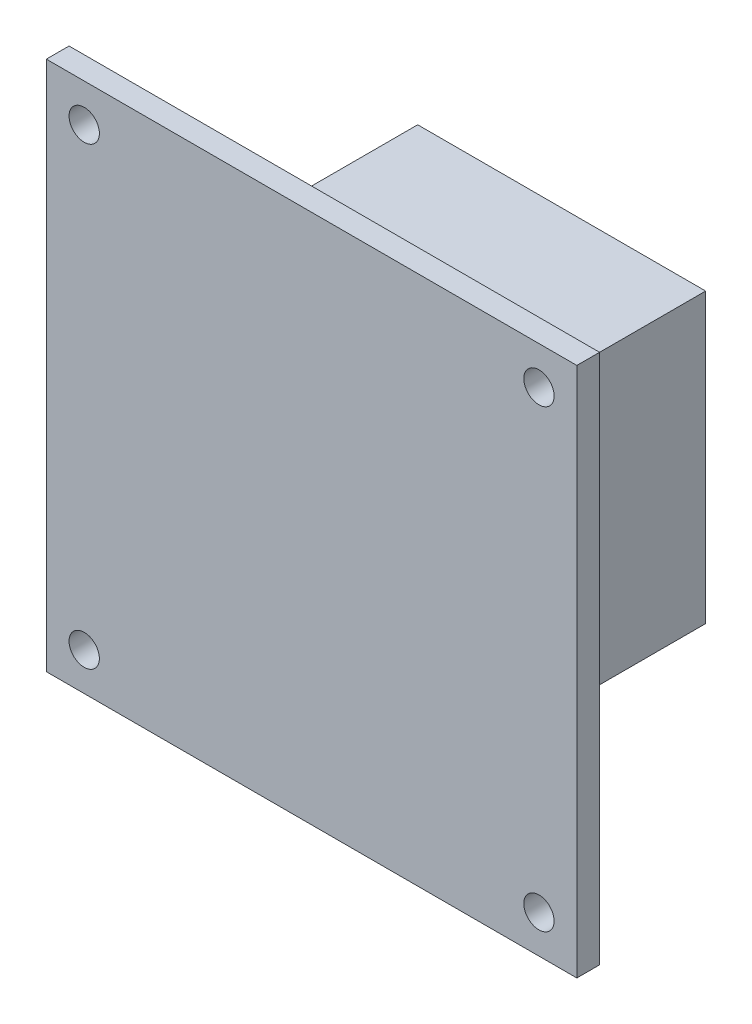
ISO-10303-21;
HEADER;
FILE_DESCRIPTION(('STEP AP214'),'2;1');
FILE_NAME('part.step','',(''),(''),'','','');
FILE_SCHEMA(('AUTOMOTIVE_DESIGN { 1 0 10303 214 1 1 1 1 }'));
ENDSEC;
DATA;
#1=APPLICATION_CONTEXT('core data for automotive mechanical design processes');
#2=APPLICATION_PROTOCOL_DEFINITION('international standard','automotive_design',2000,#1);
#3=PRODUCT_CONTEXT('',#1,'mechanical');
#4=PRODUCT('Part','Part','',(#3));
#5=PRODUCT_RELATED_PRODUCT_CATEGORY('part','',(#4));
#6=PRODUCT_DEFINITION_FORMATION('','',#4);
#7=PRODUCT_DEFINITION_CONTEXT('part definition',#1,'design');
#8=PRODUCT_DEFINITION('design','',#6,#7);
#9=PRODUCT_DEFINITION_SHAPE('','',#8);
#10=(LENGTH_UNIT() NAMED_UNIT(*) SI_UNIT(.MILLI.,.METRE.));
#11=(NAMED_UNIT(*) PLANE_ANGLE_UNIT() SI_UNIT($,.RADIAN.));
#12=(NAMED_UNIT(*) SI_UNIT($,.STERADIAN.) SOLID_ANGLE_UNIT());
#13=UNCERTAINTY_MEASURE_WITH_UNIT(LENGTH_MEASURE(1.E-05),#10,'distance_accuracy_value','');
#14=(GEOMETRIC_REPRESENTATION_CONTEXT(3) GLOBAL_UNCERTAINTY_ASSIGNED_CONTEXT((#13)) GLOBAL_UNIT_ASSIGNED_CONTEXT((#10,
#11,#12)) REPRESENTATION_CONTEXT('',''));
#15=CARTESIAN_POINT('',(0.,0.,0.));
#16=DIRECTION('',(0.,0.,1.));
#17=DIRECTION('',(1.,0.,0.));
#18=AXIS2_PLACEMENT_3D('',#15,#16,#17);
#19=CARTESIAN_POINT('',(0.,0.,0.));
#20=DIRECTION('',(0.,0.,1.));
#21=DIRECTION('',(1.,0.,0.));
#22=AXIS2_PLACEMENT_3D('',#19,#20,#21);
#23=PLANE('',#22);
#24=CARTESIAN_POINT('',(-30.,-30.,0.));
#25=DIRECTION('',(0.,0.,1.));
#26=DIRECTION('',(1.,0.,0.));
#27=AXIS2_PLACEMENT_3D('',#24,#25,#26);
#28=CIRCLE('',#27,2.00000000000001);
#29=CARTESIAN_POINT('',(-28.,-30.,0.));
#30=VERTEX_POINT('',#29);
#31=EDGE_CURVE('E43',#30,#30,#28,.T.);
#32=ORIENTED_EDGE('',*,*,#31,.T.);
#33=EDGE_LOOP('',(#32));
#34=FACE_BOUND('',#33,.T.);
#35=CARTESIAN_POINT('',(29.9999999999998,-30.0000000000002,0.));
#36=DIRECTION('',(0.,0.,1.));
#37=DIRECTION('',(1.,0.,0.));
#38=AXIS2_PLACEMENT_3D('',#35,#36,#37);
#39=CIRCLE('',#38,2.);
#40=CARTESIAN_POINT('',(31.9999999999998,-30.0000000000002,0.));
#41=VERTEX_POINT('',#40);
#42=EDGE_CURVE('E283',#41,#41,#39,.T.);
#43=ORIENTED_EDGE('',*,*,#42,.T.);
#44=EDGE_LOOP('',(#43));
#45=FACE_BOUND('',#44,.T.);
#46=CARTESIAN_POINT('',(29.9999999999998,30.0000000000002,0.));
#47=DIRECTION('',(0.,0.,1.));
#48=DIRECTION('',(1.,0.,0.));
#49=AXIS2_PLACEMENT_3D('',#46,#47,#48);
#50=CIRCLE('',#49,2.);
#51=CARTESIAN_POINT('',(31.9999999999998,30.0000000000002,0.));
#52=VERTEX_POINT('',#51);
#53=EDGE_CURVE('E280',#52,#52,#50,.T.);
#54=ORIENTED_EDGE('',*,*,#53,.T.);
#55=EDGE_LOOP('',(#54));
#56=FACE_BOUND('',#55,.T.);
#57=CARTESIAN_POINT('',(-30.,30.,0.));
#58=DIRECTION('',(0.,0.,1.));
#59=DIRECTION('',(1.,0.,0.));
#60=AXIS2_PLACEMENT_3D('',#57,#58,#59);
#61=CIRCLE('',#60,2.00000000000001);
#62=CARTESIAN_POINT('',(-28.,30.,0.));
#63=VERTEX_POINT('',#62);
#64=EDGE_CURVE('E239',#63,#63,#61,.T.);
#65=ORIENTED_EDGE('',*,*,#64,.T.);
#66=EDGE_LOOP('',(#65));
#67=FACE_BOUND('',#66,.T.);
#68=DIRECTION('',(0.,1.,0.));
#69=VECTOR('',#68,1.);
#70=CARTESIAN_POINT('',(35.,35.,0.));
#71=LINE('',#70,#69);
#72=CARTESIAN_POINT('',(35.,-35.,0.));
#73=VERTEX_POINT('',#72);
#74=CARTESIAN_POINT('',(35.,35.,0.));
#75=VERTEX_POINT('',#74);
#76=EDGE_CURVE('E255',#73,#75,#71,.T.);
#77=ORIENTED_EDGE('',*,*,#76,.F.);
#78=DIRECTION('',(1.,0.,0.));
#79=VECTOR('',#78,1.);
#80=CARTESIAN_POINT('',(-35.,-35.,0.));
#81=LINE('',#80,#79);
#82=CARTESIAN_POINT('',(-35.,-35.,0.));
#83=VERTEX_POINT('',#82);
#84=EDGE_CURVE('E245',#83,#73,#81,.T.);
#85=ORIENTED_EDGE('',*,*,#84,.F.);
#86=DIRECTION('',(0.,-1.,0.));
#87=VECTOR('',#86,1.);
#88=CARTESIAN_POINT('',(-35.,35.,0.));
#89=LINE('',#88,#87);
#90=CARTESIAN_POINT('',(-35.,35.,0.));
#91=VERTEX_POINT('',#90);
#92=EDGE_CURVE('E262',#91,#83,#89,.T.);
#93=ORIENTED_EDGE('',*,*,#92,.F.);
#94=DIRECTION('',(-1.,0.,0.));
#95=VECTOR('',#94,1.);
#96=CARTESIAN_POINT('',(-35.,35.,0.));
#97=LINE('',#96,#95);
#98=EDGE_CURVE('E259',#75,#91,#97,.T.);
#99=ORIENTED_EDGE('',*,*,#98,.F.);
#100=EDGE_LOOP('',(#77,#85,#93,#99));
#101=FACE_BOUND('',#100,.T.);
#102=DIRECTION('',(0.,1.,0.));
#103=VECTOR('',#102,1.);
#104=CARTESIAN_POINT('',(-19.,19.,0.));
#105=LINE('',#104,#103);
#106=CARTESIAN_POINT('',(-19.,-19.,0.));
#107=VERTEX_POINT('',#106);
#108=CARTESIAN_POINT('',(-19.,19.,0.));
#109=VERTEX_POINT('',#108);
#110=EDGE_CURVE('E150',#107,#109,#105,.T.);
#111=ORIENTED_EDGE('',*,*,#110,.F.);
#112=DIRECTION('',(-1.,0.,0.));
#113=VECTOR('',#112,1.);
#114=CARTESIAN_POINT('',(19.,-19.,0.));
#115=LINE('',#114,#113);
#116=CARTESIAN_POINT('',(19.,-19.,0.));
#117=VERTEX_POINT('',#116);
#118=EDGE_CURVE('E189',#117,#107,#115,.T.);
#119=ORIENTED_EDGE('',*,*,#118,.F.);
#120=DIRECTION('',(0.,-1.,0.));
#121=VECTOR('',#120,1.);
#122=CARTESIAN_POINT('',(19.,19.,0.));
#123=LINE('',#122,#121);
#124=CARTESIAN_POINT('',(19.,19.,0.));
#125=VERTEX_POINT('',#124);
#126=EDGE_CURVE('E62',#125,#117,#123,.T.);
#127=ORIENTED_EDGE('',*,*,#126,.F.);
#128=DIRECTION('',(1.,0.,0.));
#129=VECTOR('',#128,1.);
#130=CARTESIAN_POINT('',(19.,19.,0.));
#131=LINE('',#130,#129);
#132=EDGE_CURVE('E57',#109,#125,#131,.T.);
#133=ORIENTED_EDGE('',*,*,#132,.F.);
#134=EDGE_LOOP('',(#111,#119,#127,#133));
#135=FACE_BOUND('',#134,.T.);
#136=ADVANCED_FACE('F39',(#34,#45,#56,#67,#101,#135),#23,.F.);
#137=CARTESIAN_POINT('',(35.,35.,3.));
#138=DIRECTION('',(-1.,0.,0.));
#139=DIRECTION('',(0.,-1.,0.));
#140=AXIS2_PLACEMENT_3D('',#137,#138,#139);
#141=PLANE('',#140);
#142=ORIENTED_EDGE('',*,*,#76,.T.);
#143=DIRECTION('',(0.,0.,-1.));
#144=VECTOR('',#143,1.);
#145=CARTESIAN_POINT('',(35.,35.,3.));
#146=LINE('',#145,#144);
#147=CARTESIAN_POINT('',(35.,35.,3.));
#148=VERTEX_POINT('',#147);
#149=EDGE_CURVE('E11',#148,#75,#146,.T.);
#150=ORIENTED_EDGE('',*,*,#149,.F.);
#151=DIRECTION('',(0.,1.,0.));
#152=VECTOR('',#151,1.);
#153=CARTESIAN_POINT('',(35.,35.,3.));
#154=LINE('',#153,#152);
#155=CARTESIAN_POINT('',(35.,-35.,3.));
#156=VERTEX_POINT('',#155);
#157=EDGE_CURVE('E240',#156,#148,#154,.T.);
#158=ORIENTED_EDGE('',*,*,#157,.F.);
#159=DIRECTION('',(0.,0.,-1.));
#160=VECTOR('',#159,1.);
#161=CARTESIAN_POINT('',(35.,-35.,3.));
#162=LINE('',#161,#160);
#163=EDGE_CURVE('E254',#156,#73,#162,.T.);
#164=ORIENTED_EDGE('',*,*,#163,.T.);
#165=EDGE_LOOP('',(#142,#150,#158,#164));
#166=FACE_BOUND('',#165,.T.);
#167=ADVANCED_FACE('F41',(#166),#141,.F.);
#168=CARTESIAN_POINT('',(-35.,35.,3.));
#169=DIRECTION('',(0.,-1.,0.));
#170=DIRECTION('',(0.,0.,-1.));
#171=AXIS2_PLACEMENT_3D('',#168,#169,#170);
#172=PLANE('',#171);
#173=ORIENTED_EDGE('',*,*,#98,.T.);
#174=DIRECTION('',(0.,0.,-1.));
#175=VECTOR('',#174,1.);
#176=CARTESIAN_POINT('',(-35.,35.,3.));
#177=LINE('',#176,#175);
#178=CARTESIAN_POINT('',(-35.,35.,3.));
#179=VERTEX_POINT('',#178);
#180=EDGE_CURVE('E49',#179,#91,#177,.T.);
#181=ORIENTED_EDGE('',*,*,#180,.F.);
#182=DIRECTION('',(-1.,0.,0.));
#183=VECTOR('',#182,1.);
#184=CARTESIAN_POINT('',(-35.,35.,3.));
#185=LINE('',#184,#183);
#186=EDGE_CURVE('E244',#148,#179,#185,.T.);
#187=ORIENTED_EDGE('',*,*,#186,.F.);
#188=ORIENTED_EDGE('',*,*,#149,.T.);
#189=EDGE_LOOP('',(#173,#181,#187,#188));
#190=FACE_BOUND('',#189,.T.);
#191=ADVANCED_FACE('F315',(#190),#172,.F.);
#192=CARTESIAN_POINT('',(-35.,35.,3.));
#193=DIRECTION('',(1.,0.,0.));
#194=DIRECTION('',(0.,1.,0.));
#195=AXIS2_PLACEMENT_3D('',#192,#193,#194);
#196=PLANE('',#195);
#197=ORIENTED_EDGE('',*,*,#92,.T.);
#198=DIRECTION('',(0.,0.,-1.));
#199=VECTOR('',#198,1.);
#200=CARTESIAN_POINT('',(-35.,-35.,3.));
#201=LINE('',#200,#199);
#202=CARTESIAN_POINT('',(-35.,-35.,3.));
#203=VERTEX_POINT('',#202);
#204=EDGE_CURVE('E270',#203,#83,#201,.T.);
#205=ORIENTED_EDGE('',*,*,#204,.F.);
#206=DIRECTION('',(0.,-1.,0.));
#207=VECTOR('',#206,1.);
#208=CARTESIAN_POINT('',(-35.,35.,3.));
#209=LINE('',#208,#207);
#210=EDGE_CURVE('E248',#179,#203,#209,.T.);
#211=ORIENTED_EDGE('',*,*,#210,.F.);
#212=ORIENTED_EDGE('',*,*,#180,.T.);
#213=EDGE_LOOP('',(#197,#205,#211,#212));
#214=FACE_BOUND('',#213,.T.);
#215=ADVANCED_FACE('F389',(#214),#196,.F.);
#216=CARTESIAN_POINT('',(-35.,-35.,3.));
#217=DIRECTION('',(0.,1.,0.));
#218=DIRECTION('',(0.,0.,1.));
#219=AXIS2_PLACEMENT_3D('',#216,#217,#218);
#220=PLANE('',#219);
#221=ORIENTED_EDGE('',*,*,#84,.T.);
#222=ORIENTED_EDGE('',*,*,#163,.F.);
#223=DIRECTION('',(1.,0.,0.));
#224=VECTOR('',#223,1.);
#225=CARTESIAN_POINT('',(-35.,-35.,3.));
#226=LINE('',#225,#224);
#227=EDGE_CURVE('E251',#203,#156,#226,.T.);
#228=ORIENTED_EDGE('',*,*,#227,.F.);
#229=ORIENTED_EDGE('',*,*,#204,.T.);
#230=EDGE_LOOP('',(#221,#222,#228,#229));
#231=FACE_BOUND('',#230,.T.);
#232=ADVANCED_FACE('F385',(#231),#220,.F.);
#233=CARTESIAN_POINT('',(0.,0.,3.));
#234=DIRECTION('',(0.,0.,1.));
#235=DIRECTION('',(1.,0.,0.));
#236=AXIS2_PLACEMENT_3D('',#233,#234,#235);
#237=PLANE('',#236);
#238=CARTESIAN_POINT('',(-30.,-30.,3.));
#239=DIRECTION('',(0.,0.,1.));
#240=DIRECTION('',(-1.,0.,0.));
#241=AXIS2_PLACEMENT_3D('',#238,#239,#240);
#242=CIRCLE('',#241,2.00000000000001);
#243=CARTESIAN_POINT('',(-32.,-30.,3.));
#244=VERTEX_POINT('',#243);
#245=EDGE_CURVE('E223',#244,#244,#242,.T.);
#246=ORIENTED_EDGE('',*,*,#245,.F.);
#247=EDGE_LOOP('',(#246));
#248=FACE_BOUND('',#247,.T.);
#249=CARTESIAN_POINT('',(29.9999999999998,-30.0000000000002,3.));
#250=DIRECTION('',(0.,0.,1.));
#251=DIRECTION('',(1.,0.,0.));
#252=AXIS2_PLACEMENT_3D('',#249,#250,#251);
#253=CIRCLE('',#252,2.);
#254=CARTESIAN_POINT('',(31.9999999999998,-30.0000000000002,3.));
#255=VERTEX_POINT('',#254);
#256=EDGE_CURVE('E229',#255,#255,#253,.T.);
#257=ORIENTED_EDGE('',*,*,#256,.F.);
#258=EDGE_LOOP('',(#257));
#259=FACE_BOUND('',#258,.T.);
#260=CARTESIAN_POINT('',(29.9999999999998,30.0000000000002,3.));
#261=DIRECTION('',(0.,0.,1.));
#262=DIRECTION('',(-1.,0.,0.));
#263=AXIS2_PLACEMENT_3D('',#260,#261,#262);
#264=CIRCLE('',#263,2.);
#265=CARTESIAN_POINT('',(27.9999999999998,30.0000000000002,3.));
#266=VERTEX_POINT('',#265);
#267=EDGE_CURVE('E224',#266,#266,#264,.T.);
#268=ORIENTED_EDGE('',*,*,#267,.F.);
#269=EDGE_LOOP('',(#268));
#270=FACE_BOUND('',#269,.T.);
#271=CARTESIAN_POINT('',(-30.,30.,3.));
#272=DIRECTION('',(0.,0.,1.));
#273=DIRECTION('',(1.,0.,0.));
#274=AXIS2_PLACEMENT_3D('',#271,#272,#273);
#275=CIRCLE('',#274,2.00000000000001);
#276=CARTESIAN_POINT('',(-28.,30.,3.));
#277=VERTEX_POINT('',#276);
#278=EDGE_CURVE('E228',#277,#277,#275,.T.);
#279=ORIENTED_EDGE('',*,*,#278,.F.);
#280=EDGE_LOOP('',(#279));
#281=FACE_BOUND('',#280,.T.);
#282=ORIENTED_EDGE('',*,*,#157,.T.);
#283=ORIENTED_EDGE('',*,*,#186,.T.);
#284=ORIENTED_EDGE('',*,*,#210,.T.);
#285=ORIENTED_EDGE('',*,*,#227,.T.);
#286=EDGE_LOOP('',(#282,#283,#284,#285));
#287=FACE_BOUND('',#286,.T.);
#288=ADVANCED_FACE('F361',(#248,#259,#270,#281,#287),#237,.T.);
#289=CARTESIAN_POINT('',(-30.,30.,-1.));
#290=DIRECTION('',(0.,0.,1.));
#291=DIRECTION('',(1.,0.,0.));
#292=AXIS2_PLACEMENT_3D('',#289,#290,#291);
#293=CYLINDRICAL_SURFACE('',#292,2.00000000000001);
#294=ORIENTED_EDGE('',*,*,#278,.T.);
#295=EDGE_LOOP('',(#294));
#296=FACE_BOUND('',#295,.T.);
#297=ORIENTED_EDGE('',*,*,#64,.F.);
#298=EDGE_LOOP('',(#297));
#299=FACE_BOUND('',#298,.T.);
#300=ADVANCED_FACE('F356',(#296,#299),#293,.F.);
#301=CARTESIAN_POINT('',(29.9999999999998,30.0000000000002,-1.));
#302=DIRECTION('',(0.,0.,1.));
#303=DIRECTION('',(1.,0.,0.));
#304=AXIS2_PLACEMENT_3D('',#301,#302,#303);
#305=CYLINDRICAL_SURFACE('',#304,2.);
#306=ORIENTED_EDGE('',*,*,#267,.T.);
#307=EDGE_LOOP('',(#306));
#308=FACE_BOUND('',#307,.T.);
#309=ORIENTED_EDGE('',*,*,#53,.F.);
#310=EDGE_LOOP('',(#309));
#311=FACE_BOUND('',#310,.T.);
#312=ADVANCED_FACE('F305',(#308,#311),#305,.F.);
#313=CARTESIAN_POINT('',(29.9999999999998,-30.0000000000002,-1.));
#314=DIRECTION('',(0.,0.,1.));
#315=DIRECTION('',(1.,0.,0.));
#316=AXIS2_PLACEMENT_3D('',#313,#314,#315);
#317=CYLINDRICAL_SURFACE('',#316,2.);
#318=ORIENTED_EDGE('',*,*,#256,.T.);
#319=EDGE_LOOP('',(#318));
#320=FACE_BOUND('',#319,.T.);
#321=ORIENTED_EDGE('',*,*,#42,.F.);
#322=EDGE_LOOP('',(#321));
#323=FACE_BOUND('',#322,.T.);
#324=ADVANCED_FACE('F295',(#320,#323),#317,.F.);
#325=CARTESIAN_POINT('',(-30.,-30.,-1.));
#326=DIRECTION('',(0.,0.,1.));
#327=DIRECTION('',(1.,0.,0.));
#328=AXIS2_PLACEMENT_3D('',#325,#326,#327);
#329=CYLINDRICAL_SURFACE('',#328,2.00000000000001);
#330=ORIENTED_EDGE('',*,*,#245,.T.);
#331=EDGE_LOOP('',(#330));
#332=FACE_BOUND('',#331,.T.);
#333=ORIENTED_EDGE('',*,*,#31,.F.);
#334=EDGE_LOOP('',(#333));
#335=FACE_BOUND('',#334,.T.);
#336=ADVANCED_FACE('F293',(#332,#335),#329,.F.);
#337=CARTESIAN_POINT('',(0.,0.,-30.));
#338=DIRECTION('',(0.,0.,-1.));
#339=DIRECTION('',(-1.,0.,0.));
#340=AXIS2_PLACEMENT_3D('',#337,#338,#339);
#341=PLANE('',#340);
#342=DIRECTION('',(0.,1.,0.));
#343=VECTOR('',#342,1.);
#344=CARTESIAN_POINT('',(-19.,19.,-30.));
#345=LINE('',#344,#343);
#346=CARTESIAN_POINT('',(-19.,-19.,-30.));
#347=VERTEX_POINT('',#346);
#348=CARTESIAN_POINT('',(-19.,19.,-30.));
#349=VERTEX_POINT('',#348);
#350=EDGE_CURVE('E184',#347,#349,#345,.T.);
#351=ORIENTED_EDGE('',*,*,#350,.T.);
#352=DIRECTION('',(1.,0.,0.));
#353=VECTOR('',#352,1.);
#354=CARTESIAN_POINT('',(19.,19.,-30.));
#355=LINE('',#354,#353);
#356=CARTESIAN_POINT('',(19.,19.,-30.));
#357=VERTEX_POINT('',#356);
#358=EDGE_CURVE('E188',#349,#357,#355,.T.);
#359=ORIENTED_EDGE('',*,*,#358,.T.);
#360=DIRECTION('',(0.,-1.,0.));
#361=VECTOR('',#360,1.);
#362=CARTESIAN_POINT('',(19.,19.,-30.));
#363=LINE('',#362,#361);
#364=CARTESIAN_POINT('',(19.,-19.,-30.));
#365=VERTEX_POINT('',#364);
#366=EDGE_CURVE('E192',#357,#365,#363,.T.);
#367=ORIENTED_EDGE('',*,*,#366,.T.);
#368=DIRECTION('',(-1.,0.,0.));
#369=VECTOR('',#368,1.);
#370=CARTESIAN_POINT('',(19.,-19.,-30.));
#371=LINE('',#370,#369);
#372=EDGE_CURVE('E195',#365,#347,#371,.T.);
#373=ORIENTED_EDGE('',*,*,#372,.T.);
#374=EDGE_LOOP('',(#351,#359,#367,#373));
#375=FACE_BOUND('',#374,.T.);
#376=DIRECTION('',(1.,0.,0.));
#377=VECTOR('',#376,1.);
#378=CARTESIAN_POINT('',(17.5,17.5,-30.));
#379=LINE('',#378,#377);
#380=CARTESIAN_POINT('',(-17.5,17.5,-30.));
#381=VERTEX_POINT('',#380);
#382=CARTESIAN_POINT('',(17.5,17.5,-30.));
#383=VERTEX_POINT('',#382);
#384=EDGE_CURVE('E141',#381,#383,#379,.T.);
#385=ORIENTED_EDGE('',*,*,#384,.F.);
#386=DIRECTION('',(0.,1.,0.));
#387=VECTOR('',#386,1.);
#388=CARTESIAN_POINT('',(-17.5,17.5,-30.));
#389=LINE('',#388,#387);
#390=CARTESIAN_POINT('',(-17.5,-17.5,-30.));
#391=VERTEX_POINT('',#390);
#392=EDGE_CURVE('E130',#391,#381,#389,.T.);
#393=ORIENTED_EDGE('',*,*,#392,.F.);
#394=DIRECTION('',(-1.,0.,0.));
#395=VECTOR('',#394,1.);
#396=CARTESIAN_POINT('',(17.5,-17.5,-30.));
#397=LINE('',#396,#395);
#398=CARTESIAN_POINT('',(17.5,-17.5,-30.));
#399=VERTEX_POINT('',#398);
#400=EDGE_CURVE('E160',#399,#391,#397,.T.);
#401=ORIENTED_EDGE('',*,*,#400,.F.);
#402=DIRECTION('',(0.,-1.,0.));
#403=VECTOR('',#402,1.);
#404=CARTESIAN_POINT('',(17.5,17.5,-30.));
#405=LINE('',#404,#403);
#406=EDGE_CURVE('E156',#383,#399,#405,.T.);
#407=ORIENTED_EDGE('',*,*,#406,.F.);
#408=EDGE_LOOP('',(#385,#393,#401,#407));
#409=FACE_BOUND('',#408,.T.);
#410=ADVANCED_FACE('F154',(#375,#409),#341,.T.);
#411=CARTESIAN_POINT('',(-19.,19.,-30.));
#412=DIRECTION('',(1.,0.,0.));
#413=DIRECTION('',(0.,1.,0.));
#414=AXIS2_PLACEMENT_3D('',#411,#412,#413);
#415=PLANE('',#414);
#416=ORIENTED_EDGE('',*,*,#110,.T.);
#417=DIRECTION('',(0.,0.,1.));
#418=VECTOR('',#417,1.);
#419=CARTESIAN_POINT('',(-19.,19.,-30.));
#420=LINE('',#419,#418);
#421=EDGE_CURVE('E220',#349,#109,#420,.T.);
#422=ORIENTED_EDGE('',*,*,#421,.F.);
#423=ORIENTED_EDGE('',*,*,#350,.F.);
#424=DIRECTION('',(0.,0.,1.));
#425=VECTOR('',#424,1.);
#426=CARTESIAN_POINT('',(-19.,-19.,-30.));
#427=LINE('',#426,#425);
#428=EDGE_CURVE('E198',#347,#107,#427,.T.);
#429=ORIENTED_EDGE('',*,*,#428,.T.);
#430=EDGE_LOOP('',(#416,#422,#423,#429));
#431=FACE_BOUND('',#430,.T.);
#432=ADVANCED_FACE('F302',(#431),#415,.F.);
#433=CARTESIAN_POINT('',(19.,19.,-30.));
#434=DIRECTION('',(0.,-1.,0.));
#435=DIRECTION('',(0.,0.,-1.));
#436=AXIS2_PLACEMENT_3D('',#433,#434,#435);
#437=PLANE('',#436);
#438=ORIENTED_EDGE('',*,*,#132,.T.);
#439=DIRECTION('',(0.,0.,1.));
#440=VECTOR('',#439,1.);
#441=CARTESIAN_POINT('',(19.,19.,-30.));
#442=LINE('',#441,#440);
#443=EDGE_CURVE('E216',#357,#125,#442,.T.);
#444=ORIENTED_EDGE('',*,*,#443,.F.);
#445=ORIENTED_EDGE('',*,*,#358,.F.);
#446=ORIENTED_EDGE('',*,*,#421,.T.);
#447=EDGE_LOOP('',(#438,#444,#445,#446));
#448=FACE_BOUND('',#447,.T.);
#449=ADVANCED_FACE('F347',(#448),#437,.F.);
#450=CARTESIAN_POINT('',(19.,19.,-30.));
#451=DIRECTION('',(-1.,0.,0.));
#452=DIRECTION('',(0.,-1.,0.));
#453=AXIS2_PLACEMENT_3D('',#450,#451,#452);
#454=PLANE('',#453);
#455=ORIENTED_EDGE('',*,*,#126,.T.);
#456=DIRECTION('',(0.,0.,1.));
#457=VECTOR('',#456,1.);
#458=CARTESIAN_POINT('',(19.,-19.,-30.));
#459=LINE('',#458,#457);
#460=EDGE_CURVE('E212',#365,#117,#459,.T.);
#461=ORIENTED_EDGE('',*,*,#460,.F.);
#462=ORIENTED_EDGE('',*,*,#366,.F.);
#463=ORIENTED_EDGE('',*,*,#443,.T.);
#464=EDGE_LOOP('',(#455,#461,#462,#463));
#465=FACE_BOUND('',#464,.T.);
#466=ADVANCED_FACE('F343',(#465),#454,.F.);
#467=CARTESIAN_POINT('',(19.,-19.,-30.));
#468=DIRECTION('',(0.,1.,0.));
#469=DIRECTION('',(0.,0.,1.));
#470=AXIS2_PLACEMENT_3D('',#467,#468,#469);
#471=PLANE('',#470);
#472=ORIENTED_EDGE('',*,*,#118,.T.);
#473=ORIENTED_EDGE('',*,*,#428,.F.);
#474=ORIENTED_EDGE('',*,*,#372,.F.);
#475=ORIENTED_EDGE('',*,*,#460,.T.);
#476=EDGE_LOOP('',(#472,#473,#474,#475));
#477=FACE_BOUND('',#476,.T.);
#478=ADVANCED_FACE('F339',(#477),#471,.F.);
#479=CARTESIAN_POINT('',(-17.5,17.5,-30.));
#480=DIRECTION('',(1.,0.,0.));
#481=DIRECTION('',(0.,1.,0.));
#482=AXIS2_PLACEMENT_3D('',#479,#480,#481);
#483=PLANE('',#482);
#484=DIRECTION('',(0.,1.,0.));
#485=VECTOR('',#484,1.);
#486=CARTESIAN_POINT('',(-17.5,17.5,0.));
#487=LINE('',#486,#485);
#488=CARTESIAN_POINT('',(-17.5,-17.5,0.));
#489=VERTEX_POINT('',#488);
#490=CARTESIAN_POINT('',(-17.5,17.5,0.));
#491=VERTEX_POINT('',#490);
#492=EDGE_CURVE('E165',#489,#491,#487,.T.);
#493=ORIENTED_EDGE('',*,*,#492,.F.);
#494=DIRECTION('',(0.,0.,1.));
#495=VECTOR('',#494,1.);
#496=CARTESIAN_POINT('',(-17.5,-17.5,-30.));
#497=LINE('',#496,#495);
#498=EDGE_CURVE('E136',#391,#489,#497,.T.);
#499=ORIENTED_EDGE('',*,*,#498,.F.);
#500=ORIENTED_EDGE('',*,*,#392,.T.);
#501=DIRECTION('',(0.,0.,1.));
#502=VECTOR('',#501,1.);
#503=CARTESIAN_POINT('',(-17.5,17.5,-30.));
#504=LINE('',#503,#502);
#505=EDGE_CURVE('E134',#381,#491,#504,.T.);
#506=ORIENTED_EDGE('',*,*,#505,.T.);
#507=EDGE_LOOP('',(#493,#499,#500,#506));
#508=FACE_BOUND('',#507,.T.);
#509=ADVANCED_FACE('F133',(#508),#483,.T.);
#510=CARTESIAN_POINT('',(17.5,17.5,-30.));
#511=DIRECTION('',(0.,-1.,0.));
#512=DIRECTION('',(0.,0.,-1.));
#513=AXIS2_PLACEMENT_3D('',#510,#511,#512);
#514=PLANE('',#513);
#515=DIRECTION('',(1.,0.,0.));
#516=VECTOR('',#515,1.);
#517=CARTESIAN_POINT('',(17.5,17.5,0.));
#518=LINE('',#517,#516);
#519=CARTESIAN_POINT('',(17.5,17.5,0.));
#520=VERTEX_POINT('',#519);
#521=EDGE_CURVE('E148',#491,#520,#518,.T.);
#522=ORIENTED_EDGE('',*,*,#521,.F.);
#523=ORIENTED_EDGE('',*,*,#505,.F.);
#524=ORIENTED_EDGE('',*,*,#384,.T.);
#525=DIRECTION('',(0.,0.,1.));
#526=VECTOR('',#525,1.);
#527=CARTESIAN_POINT('',(17.5,17.5,-30.));
#528=LINE('',#527,#526);
#529=EDGE_CURVE('E151',#383,#520,#528,.T.);
#530=ORIENTED_EDGE('',*,*,#529,.T.);
#531=EDGE_LOOP('',(#522,#523,#524,#530));
#532=FACE_BOUND('',#531,.T.);
#533=ADVANCED_FACE('F145',(#532),#514,.T.);
#534=CARTESIAN_POINT('',(17.5,17.5,-30.));
#535=DIRECTION('',(-1.,0.,0.));
#536=DIRECTION('',(0.,-1.,0.));
#537=AXIS2_PLACEMENT_3D('',#534,#535,#536);
#538=PLANE('',#537);
#539=DIRECTION('',(0.,-1.,0.));
#540=VECTOR('',#539,1.);
#541=CARTESIAN_POINT('',(17.5,17.5,0.));
#542=LINE('',#541,#540);
#543=CARTESIAN_POINT('',(17.5,-17.5,0.));
#544=VERTEX_POINT('',#543);
#545=EDGE_CURVE('E170',#520,#544,#542,.T.);
#546=ORIENTED_EDGE('',*,*,#545,.F.);
#547=ORIENTED_EDGE('',*,*,#529,.F.);
#548=ORIENTED_EDGE('',*,*,#406,.T.);
#549=DIRECTION('',(0.,0.,1.));
#550=VECTOR('',#549,1.);
#551=CARTESIAN_POINT('',(17.5,-17.5,-30.));
#552=LINE('',#551,#550);
#553=EDGE_CURVE('E179',#399,#544,#552,.T.);
#554=ORIENTED_EDGE('',*,*,#553,.T.);
#555=EDGE_LOOP('',(#546,#547,#548,#554));
#556=FACE_BOUND('',#555,.T.);
#557=ADVANCED_FACE('F325',(#556),#538,.T.);
#558=CARTESIAN_POINT('',(17.5,-17.5,-30.));
#559=DIRECTION('',(0.,1.,0.));
#560=DIRECTION('',(0.,0.,1.));
#561=AXIS2_PLACEMENT_3D('',#558,#559,#560);
#562=PLANE('',#561);
#563=DIRECTION('',(-1.,0.,0.));
#564=VECTOR('',#563,1.);
#565=CARTESIAN_POINT('',(17.5,-17.5,0.));
#566=LINE('',#565,#564);
#567=EDGE_CURVE('E142',#544,#489,#566,.T.);
#568=ORIENTED_EDGE('',*,*,#567,.F.);
#569=ORIENTED_EDGE('',*,*,#553,.F.);
#570=ORIENTED_EDGE('',*,*,#400,.T.);
#571=ORIENTED_EDGE('',*,*,#498,.T.);
#572=EDGE_LOOP('',(#568,#569,#570,#571));
#573=FACE_BOUND('',#572,.T.);
#574=ADVANCED_FACE('F320',(#573),#562,.T.);
#575=ORIENTED_EDGE('',*,*,#567,.T.);
#576=ORIENTED_EDGE('',*,*,#492,.T.);
#577=ORIENTED_EDGE('',*,*,#521,.T.);
#578=ORIENTED_EDGE('',*,*,#545,.T.);
#579=EDGE_LOOP('',(#575,#576,#577,#578));
#580=FACE_BOUND('',#579,.T.);
#581=ADVANCED_FACE('F311',(#580),#23,.F.);
#582=CLOSED_SHELL('',(#136,#167,#191,#215,#232,#288,#300,#312,#324,#336,#410,#432,#449,#466,
#478,#509,#533,#557,#574,#581));
#583=MANIFOLD_SOLID_BREP('B2',#582);
#584=ADVANCED_BREP_SHAPE_REPRESENTATION('',(#18,#583),#14);
#585=SHAPE_DEFINITION_REPRESENTATION(#9,#584);
ENDSEC;
END-ISO-10303-21;
